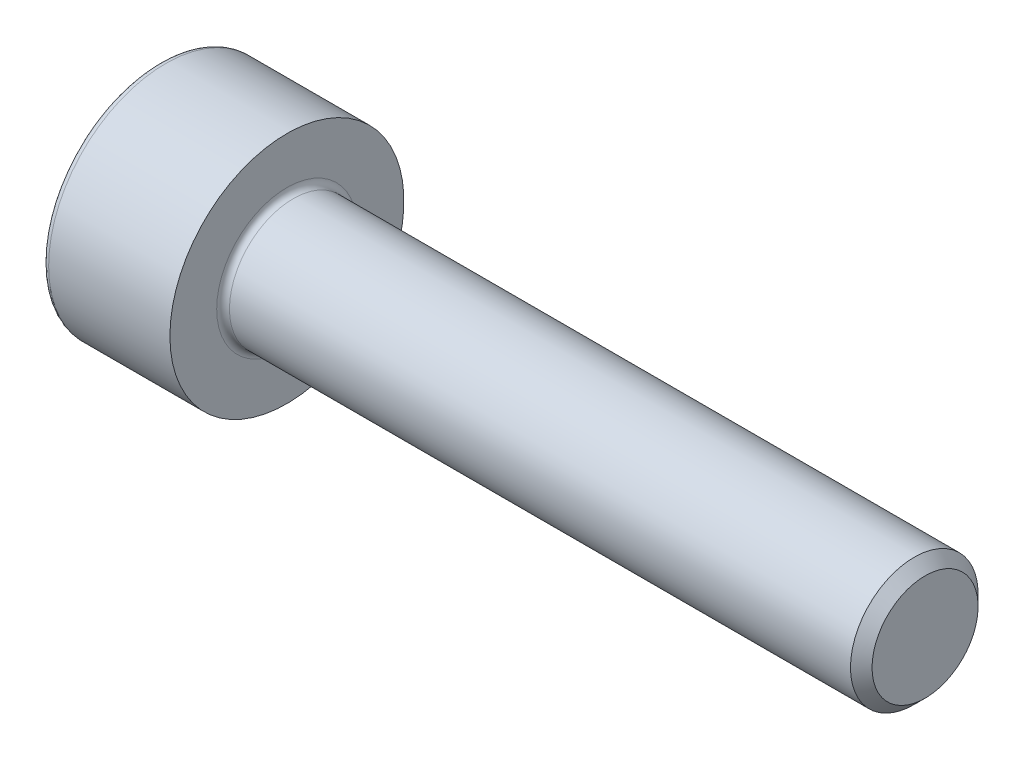
ISO-10303-21;
HEADER;
FILE_DESCRIPTION(('STEP AP214'),'2;1');
FILE_NAME('part.step','',(''),(''),'','','');
FILE_SCHEMA(('AUTOMOTIVE_DESIGN { 1 0 10303 214 1 1 1 1 }'));
ENDSEC;
DATA;
#1=APPLICATION_CONTEXT('core data for automotive mechanical design processes');
#2=APPLICATION_PROTOCOL_DEFINITION('international standard','automotive_design',2000,#1);
#3=PRODUCT_CONTEXT('',#1,'mechanical');
#4=PRODUCT('Part','Part','',(#3));
#5=PRODUCT_RELATED_PRODUCT_CATEGORY('part','',(#4));
#6=PRODUCT_DEFINITION_FORMATION('','',#4);
#7=PRODUCT_DEFINITION_CONTEXT('part definition',#1,'design');
#8=PRODUCT_DEFINITION('design','',#6,#7);
#9=PRODUCT_DEFINITION_SHAPE('','',#8);
#10=(LENGTH_UNIT() NAMED_UNIT(*) SI_UNIT(.MILLI.,.METRE.));
#11=(NAMED_UNIT(*) PLANE_ANGLE_UNIT() SI_UNIT($,.RADIAN.));
#12=(NAMED_UNIT(*) SI_UNIT($,.STERADIAN.) SOLID_ANGLE_UNIT());
#13=UNCERTAINTY_MEASURE_WITH_UNIT(LENGTH_MEASURE(1.E-05),#10,'distance_accuracy_value','');
#14=(GEOMETRIC_REPRESENTATION_CONTEXT(3) GLOBAL_UNCERTAINTY_ASSIGNED_CONTEXT((#13)) GLOBAL_UNIT_ASSIGNED_CONTEXT((#10,
#11,#12)) REPRESENTATION_CONTEXT('',''));
#15=CARTESIAN_POINT('',(0.,0.,0.));
#16=DIRECTION('',(0.,0.,1.));
#17=DIRECTION('',(1.,0.,0.));
#18=AXIS2_PLACEMENT_3D('',#15,#16,#17);
#19=CARTESIAN_POINT('',(15.,0.,0.));
#20=DIRECTION('',(-1.,0.,0.));
#21=DIRECTION('',(0.,0.,1.));
#22=AXIS2_PLACEMENT_3D('',#19,#20,#21);
#23=CONICAL_SURFACE('',#22,1.2464999999935,0.785398163397455);
#24=CARTESIAN_POINT('',(14.7464999999935,0.,0.));
#25=DIRECTION('',(-1.,0.,0.));
#26=DIRECTION('',(0.,0.,1.));
#27=AXIS2_PLACEMENT_3D('',#24,#25,#26);
#28=CIRCLE('',#27,1.5);
#29=CARTESIAN_POINT('',(14.7464999999935,0.,1.5));
#30=VERTEX_POINT('',#29);
#31=EDGE_CURVE('E11',#30,#30,#28,.T.);
#32=ORIENTED_EDGE('',*,*,#31,.F.);
#33=EDGE_LOOP('',(#32));
#34=FACE_BOUND('',#33,.T.);
#35=CARTESIAN_POINT('',(15.,0.,0.));
#36=DIRECTION('',(-1.,0.,0.));
#37=DIRECTION('',(0.,0.,1.));
#38=AXIS2_PLACEMENT_3D('',#35,#36,#37);
#39=CIRCLE('',#38,1.2464999999935);
#40=CARTESIAN_POINT('',(15.,0.,1.2464999999935));
#41=VERTEX_POINT('',#40);
#42=EDGE_CURVE('E134',#41,#41,#39,.T.);
#43=ORIENTED_EDGE('',*,*,#42,.T.);
#44=EDGE_LOOP('',(#43));
#45=FACE_BOUND('',#44,.T.);
#46=ADVANCED_FACE('F33',(#34,#45),#23,.T.);
#47=CARTESIAN_POINT('',(-3.,0.,0.));
#48=DIRECTION('',(-1.,0.,0.));
#49=DIRECTION('',(0.,0.,1.));
#50=AXIS2_PLACEMENT_3D('',#47,#48,#49);
#51=CYLINDRICAL_SURFACE('',#50,1.5);
#52=CARTESIAN_POINT('',(0.15,0.,0.));
#53=DIRECTION('',(-1.,0.,0.));
#54=DIRECTION('',(0.,0.,1.));
#55=AXIS2_PLACEMENT_3D('',#52,#53,#54);
#56=CIRCLE('',#55,1.5);
#57=CARTESIAN_POINT('',(0.15,0.,1.5));
#58=VERTEX_POINT('',#57);
#59=EDGE_CURVE('E40',#58,#58,#56,.T.);
#60=ORIENTED_EDGE('',*,*,#59,.F.);
#61=EDGE_LOOP('',(#60));
#62=FACE_BOUND('',#61,.T.);
#63=ORIENTED_EDGE('',*,*,#31,.T.);
#64=EDGE_LOOP('',(#63));
#65=FACE_BOUND('',#64,.T.);
#66=ADVANCED_FACE('F158',(#62,#65),#51,.T.);
#67=CARTESIAN_POINT('',(0.15,0.,0.));
#68=DIRECTION('',(-1.,0.,0.));
#69=DIRECTION('',(0.,0.,1.));
#70=AXIS2_PLACEMENT_3D('',#67,#68,#69);
#71=TOROIDAL_SURFACE('',#70,1.65,0.15);
#72=CARTESIAN_POINT('',(0.,0.,0.));
#73=DIRECTION('',(-1.,0.,0.));
#74=DIRECTION('',(0.,0.,1.));
#75=AXIS2_PLACEMENT_3D('',#72,#73,#74);
#76=CIRCLE('',#75,1.65);
#77=CARTESIAN_POINT('',(0.,0.,1.65));
#78=VERTEX_POINT('',#77);
#79=EDGE_CURVE('E151',#78,#78,#76,.T.);
#80=ORIENTED_EDGE('',*,*,#79,.F.);
#81=EDGE_LOOP('',(#80));
#82=FACE_BOUND('',#81,.T.);
#83=ORIENTED_EDGE('',*,*,#59,.T.);
#84=EDGE_LOOP('',(#83));
#85=FACE_BOUND('',#84,.T.);
#86=ADVANCED_FACE('F156',(#82,#85),#71,.F.);
#87=CARTESIAN_POINT('',(0.,1.65,0.));
#88=DIRECTION('',(-1.,0.,0.));
#89=DIRECTION('',(0.,0.,1.));
#90=AXIS2_PLACEMENT_3D('',#87,#88,#89);
#91=PLANE('',#90);
#92=CARTESIAN_POINT('',(0.,0.,0.));
#93=DIRECTION('',(-1.,0.,0.));
#94=DIRECTION('',(0.,0.,1.));
#95=AXIS2_PLACEMENT_3D('',#92,#93,#94);
#96=CIRCLE('',#95,2.75);
#97=CARTESIAN_POINT('',(0.,0.,2.75));
#98=VERTEX_POINT('',#97);
#99=EDGE_CURVE('E148',#98,#98,#96,.T.);
#100=ORIENTED_EDGE('',*,*,#99,.F.);
#101=EDGE_LOOP('',(#100));
#102=FACE_BOUND('',#101,.T.);
#103=ORIENTED_EDGE('',*,*,#79,.T.);
#104=EDGE_LOOP('',(#103));
#105=FACE_BOUND('',#104,.T.);
#106=ADVANCED_FACE('F189',(#102,#105),#91,.F.);
#107=CARTESIAN_POINT('',(-3.,0.,0.));
#108=DIRECTION('',(-1.,0.,0.));
#109=DIRECTION('',(0.,0.,1.));
#110=AXIS2_PLACEMENT_3D('',#107,#108,#109);
#111=CYLINDRICAL_SURFACE('',#110,2.75);
#112=CARTESIAN_POINT('',(-2.85,0.,0.));
#113=DIRECTION('',(-1.,0.,0.));
#114=DIRECTION('',(0.,0.,1.));
#115=AXIS2_PLACEMENT_3D('',#112,#113,#114);
#116=CIRCLE('',#115,2.75);
#117=CARTESIAN_POINT('',(-2.85,0.,2.75));
#118=VERTEX_POINT('',#117);
#119=EDGE_CURVE('E145',#118,#118,#116,.T.);
#120=ORIENTED_EDGE('',*,*,#119,.F.);
#121=EDGE_LOOP('',(#120));
#122=FACE_BOUND('',#121,.T.);
#123=ORIENTED_EDGE('',*,*,#99,.T.);
#124=EDGE_LOOP('',(#123));
#125=FACE_BOUND('',#124,.T.);
#126=ADVANCED_FACE('F185',(#122,#125),#111,.T.);
#127=CARTESIAN_POINT('',(-2.85,0.,0.));
#128=DIRECTION('',(-1.,0.,0.));
#129=DIRECTION('',(0.,0.,1.));
#130=AXIS2_PLACEMENT_3D('',#127,#128,#129);
#131=TOROIDAL_SURFACE('',#130,2.6,0.15);
#132=CARTESIAN_POINT('',(-3.,0.,0.));
#133=DIRECTION('',(-1.,0.,0.));
#134=DIRECTION('',(0.,0.,1.));
#135=AXIS2_PLACEMENT_3D('',#132,#133,#134);
#136=CIRCLE('',#135,2.6);
#137=CARTESIAN_POINT('',(-3.,0.,2.6));
#138=VERTEX_POINT('',#137);
#139=EDGE_CURVE('E142',#138,#138,#136,.T.);
#140=ORIENTED_EDGE('',*,*,#139,.F.);
#141=EDGE_LOOP('',(#140));
#142=FACE_BOUND('',#141,.T.);
#143=ORIENTED_EDGE('',*,*,#119,.T.);
#144=EDGE_LOOP('',(#143));
#145=FACE_BOUND('',#144,.T.);
#146=ADVANCED_FACE('F178',(#142,#145),#131,.T.);
#147=CARTESIAN_POINT('',(-3.,2.6,0.));
#148=DIRECTION('',(1.,0.,0.));
#149=DIRECTION('',(0.,0.,-1.));
#150=AXIS2_PLACEMENT_3D('',#147,#148,#149);
#151=PLANE('',#150);
#152=DIRECTION('',(0.,0.5,-0.866025403784438));
#153=VECTOR('',#152,1.);
#154=CARTESIAN_POINT('',(-3.,0.739008344562721,1.28));
#155=LINE('',#154,#153);
#156=CARTESIAN_POINT('',(-3.,0.739008344562721,1.28));
#157=VERTEX_POINT('',#156);
#158=CARTESIAN_POINT('',(-3.,1.47801668912544,0.));
#159=VERTEX_POINT('',#158);
#160=EDGE_CURVE('E121',#157,#159,#155,.T.);
#161=ORIENTED_EDGE('',*,*,#160,.F.);
#162=DIRECTION('',(0.,1.,0.));
#163=VECTOR('',#162,1.);
#164=CARTESIAN_POINT('',(-3.,-0.739008344562722,1.28));
#165=LINE('',#164,#163);
#166=CARTESIAN_POINT('',(-3.,-0.739008344562722,1.28));
#167=VERTEX_POINT('',#166);
#168=EDGE_CURVE('E47',#167,#157,#165,.T.);
#169=ORIENTED_EDGE('',*,*,#168,.F.);
#170=DIRECTION('',(0.,0.5,0.866025403784439));
#171=VECTOR('',#170,1.);
#172=CARTESIAN_POINT('',(-3.,-1.47801668912544,0.));
#173=LINE('',#172,#171);
#174=CARTESIAN_POINT('',(-3.,-1.47801668912544,0.));
#175=VERTEX_POINT('',#174);
#176=EDGE_CURVE('E130',#175,#167,#173,.T.);
#177=ORIENTED_EDGE('',*,*,#176,.F.);
#178=DIRECTION('',(0.,-0.5,0.866025403784439));
#179=VECTOR('',#178,1.);
#180=CARTESIAN_POINT('',(-3.,-0.739008344562721,-1.28));
#181=LINE('',#180,#179);
#182=CARTESIAN_POINT('',(-3.,-0.739008344562721,-1.28));
#183=VERTEX_POINT('',#182);
#184=EDGE_CURVE('E128',#183,#175,#181,.T.);
#185=ORIENTED_EDGE('',*,*,#184,.F.);
#186=DIRECTION('',(0.,-1.,0.));
#187=VECTOR('',#186,1.);
#188=CARTESIAN_POINT('',(-3.,0.739008344562722,-1.28));
#189=LINE('',#188,#187);
#190=CARTESIAN_POINT('',(-3.,0.739008344562722,-1.28));
#191=VERTEX_POINT('',#190);
#192=EDGE_CURVE('E95',#191,#183,#189,.T.);
#193=ORIENTED_EDGE('',*,*,#192,.F.);
#194=DIRECTION('',(0.,-0.5,-0.866025403784439));
#195=VECTOR('',#194,1.);
#196=CARTESIAN_POINT('',(-3.,1.47801668912544,0.));
#197=LINE('',#196,#195);
#198=EDGE_CURVE('E124',#159,#191,#197,.T.);
#199=ORIENTED_EDGE('',*,*,#198,.F.);
#200=EDGE_LOOP('',(#161,#169,#177,#185,#193,#199));
#201=FACE_BOUND('',#200,.T.);
#202=ORIENTED_EDGE('',*,*,#139,.T.);
#203=EDGE_LOOP('',(#202));
#204=FACE_BOUND('',#203,.T.);
#205=ADVANCED_FACE('F170',(#201,#204),#151,.F.);
#206=CARTESIAN_POINT('',(15.,1.2464999999935,0.));
#207=DIRECTION('',(-1.,0.,0.));
#208=DIRECTION('',(0.,0.,1.));
#209=AXIS2_PLACEMENT_3D('',#206,#207,#208);
#210=PLANE('',#209);
#211=ORIENTED_EDGE('',*,*,#42,.F.);
#212=EDGE_LOOP('',(#211));
#213=FACE_BOUND('',#212,.T.);
#214=ADVANCED_FACE('F167',(#213),#210,.F.);
#215=CARTESIAN_POINT('',(-1.7,-0.739008344562722,1.28));
#216=DIRECTION('',(0.,0.,1.));
#217=DIRECTION('',(1.,0.,0.));
#218=AXIS2_PLACEMENT_3D('',#215,#216,#217);
#219=PLANE('',#218);
#220=ORIENTED_EDGE('',*,*,#168,.T.);
#221=DIRECTION('',(-1.,0.,0.));
#222=VECTOR('',#221,1.);
#223=CARTESIAN_POINT('',(-1.7,0.739008344562721,1.28));
#224=LINE('',#223,#222);
#225=CARTESIAN_POINT('',(-1.7,0.739008344562721,1.28));
#226=VERTEX_POINT('',#225);
#227=EDGE_CURVE('E77',#226,#157,#224,.T.);
#228=ORIENTED_EDGE('',*,*,#227,.F.);
#229=DIRECTION('',(0.,1.,0.));
#230=VECTOR('',#229,1.);
#231=CARTESIAN_POINT('',(-1.7,-0.739008344562722,1.28));
#232=LINE('',#231,#230);
#233=CARTESIAN_POINT('',(-1.7,-0.739008344562722,1.28));
#234=VERTEX_POINT('',#233);
#235=EDGE_CURVE('E132',#234,#226,#232,.T.);
#236=ORIENTED_EDGE('',*,*,#235,.F.);
#237=DIRECTION('',(-1.,0.,0.));
#238=VECTOR('',#237,1.);
#239=CARTESIAN_POINT('',(-1.7,-0.739008344562722,1.28));
#240=LINE('',#239,#238);
#241=EDGE_CURVE('E55',#234,#167,#240,.T.);
#242=ORIENTED_EDGE('',*,*,#241,.T.);
#243=EDGE_LOOP('',(#220,#228,#236,#242));
#244=FACE_BOUND('',#243,.T.);
#245=ADVANCED_FACE('F169',(#244),#219,.F.);
#246=CARTESIAN_POINT('',(-1.7,-1.47801668912544,0.));
#247=DIRECTION('',(0.,-0.866025403784439,0.5));
#248=DIRECTION('',(0.,-0.5,-0.866025403784439));
#249=AXIS2_PLACEMENT_3D('',#246,#247,#248);
#250=PLANE('',#249);
#251=ORIENTED_EDGE('',*,*,#176,.T.);
#252=ORIENTED_EDGE('',*,*,#241,.F.);
#253=DIRECTION('',(0.,0.5,0.866025403784439));
#254=VECTOR('',#253,1.);
#255=CARTESIAN_POINT('',(-1.7,-1.47801668912544,0.));
#256=LINE('',#255,#254);
#257=CARTESIAN_POINT('',(-1.7,-1.47801668912544,0.));
#258=VERTEX_POINT('',#257);
#259=EDGE_CURVE('E107',#258,#234,#256,.T.);
#260=ORIENTED_EDGE('',*,*,#259,.F.);
#261=DIRECTION('',(-1.,0.,0.));
#262=VECTOR('',#261,1.);
#263=CARTESIAN_POINT('',(-1.7,-1.47801668912544,0.));
#264=LINE('',#263,#262);
#265=EDGE_CURVE('E99',#258,#175,#264,.T.);
#266=ORIENTED_EDGE('',*,*,#265,.T.);
#267=EDGE_LOOP('',(#251,#252,#260,#266));
#268=FACE_BOUND('',#267,.T.);
#269=ADVANCED_FACE('F176',(#268),#250,.F.);
#270=CARTESIAN_POINT('',(-1.7,-0.739008344562721,-1.28));
#271=DIRECTION('',(0.,-0.866025403784439,-0.5));
#272=DIRECTION('',(0.,0.5,-0.866025403784439));
#273=AXIS2_PLACEMENT_3D('',#270,#271,#272);
#274=PLANE('',#273);
#275=ORIENTED_EDGE('',*,*,#184,.T.);
#276=ORIENTED_EDGE('',*,*,#265,.F.);
#277=DIRECTION('',(0.,-0.5,0.866025403784439));
#278=VECTOR('',#277,1.);
#279=CARTESIAN_POINT('',(-1.7,-0.739008344562721,-1.28));
#280=LINE('',#279,#278);
#281=CARTESIAN_POINT('',(-1.7,-0.739008344562721,-1.28));
#282=VERTEX_POINT('',#281);
#283=EDGE_CURVE('E103',#282,#258,#280,.T.);
#284=ORIENTED_EDGE('',*,*,#283,.F.);
#285=DIRECTION('',(-1.,0.,0.));
#286=VECTOR('',#285,1.);
#287=CARTESIAN_POINT('',(-1.7,-0.739008344562721,-1.28));
#288=LINE('',#287,#286);
#289=EDGE_CURVE('E88',#282,#183,#288,.T.);
#290=ORIENTED_EDGE('',*,*,#289,.T.);
#291=EDGE_LOOP('',(#275,#276,#284,#290));
#292=FACE_BOUND('',#291,.T.);
#293=ADVANCED_FACE('F104',(#292),#274,.F.);
#294=CARTESIAN_POINT('',(-1.7,0.739008344562722,-1.28));
#295=DIRECTION('',(0.,0.,-1.));
#296=DIRECTION('',(0.,1.,0.));
#297=AXIS2_PLACEMENT_3D('',#294,#295,#296);
#298=PLANE('',#297);
#299=ORIENTED_EDGE('',*,*,#192,.T.);
#300=ORIENTED_EDGE('',*,*,#289,.F.);
#301=DIRECTION('',(0.,-1.,0.));
#302=VECTOR('',#301,1.);
#303=CARTESIAN_POINT('',(-1.7,0.739008344562722,-1.28));
#304=LINE('',#303,#302);
#305=CARTESIAN_POINT('',(-1.7,0.739008344562722,-1.28));
#306=VERTEX_POINT('',#305);
#307=EDGE_CURVE('E92',#306,#282,#304,.T.);
#308=ORIENTED_EDGE('',*,*,#307,.F.);
#309=DIRECTION('',(-1.,0.,0.));
#310=VECTOR('',#309,1.);
#311=CARTESIAN_POINT('',(-1.7,0.739008344562722,-1.28));
#312=LINE('',#311,#310);
#313=EDGE_CURVE('E100',#306,#191,#312,.T.);
#314=ORIENTED_EDGE('',*,*,#313,.T.);
#315=EDGE_LOOP('',(#299,#300,#308,#314));
#316=FACE_BOUND('',#315,.T.);
#317=ADVANCED_FACE('F90',(#316),#298,.F.);
#318=CARTESIAN_POINT('',(-1.7,1.47801668912544,0.));
#319=DIRECTION('',(0.,0.866025403784439,-0.5));
#320=DIRECTION('',(0.,0.5,0.866025403784439));
#321=AXIS2_PLACEMENT_3D('',#318,#319,#320);
#322=PLANE('',#321);
#323=ORIENTED_EDGE('',*,*,#198,.T.);
#324=ORIENTED_EDGE('',*,*,#313,.F.);
#325=DIRECTION('',(0.,-0.5,-0.866025403784439));
#326=VECTOR('',#325,1.);
#327=CARTESIAN_POINT('',(-1.7,1.47801668912544,0.));
#328=LINE('',#327,#326);
#329=CARTESIAN_POINT('',(-1.7,1.47801668912544,0.));
#330=VERTEX_POINT('',#329);
#331=EDGE_CURVE('E113',#330,#306,#328,.T.);
#332=ORIENTED_EDGE('',*,*,#331,.F.);
#333=DIRECTION('',(-1.,0.,0.));
#334=VECTOR('',#333,1.);
#335=CARTESIAN_POINT('',(-1.7,1.47801668912544,0.));
#336=LINE('',#335,#334);
#337=EDGE_CURVE('E137',#330,#159,#336,.T.);
#338=ORIENTED_EDGE('',*,*,#337,.T.);
#339=EDGE_LOOP('',(#323,#324,#332,#338));
#340=FACE_BOUND('',#339,.T.);
#341=ADVANCED_FACE('F251',(#340),#322,.F.);
#342=CARTESIAN_POINT('',(-1.7,0.739008344562721,1.28));
#343=DIRECTION('',(0.,0.866025403784439,0.5));
#344=DIRECTION('',(0.,-0.5,0.866025403784439));
#345=AXIS2_PLACEMENT_3D('',#342,#343,#344);
#346=PLANE('',#345);
#347=ORIENTED_EDGE('',*,*,#160,.T.);
#348=ORIENTED_EDGE('',*,*,#337,.F.);
#349=DIRECTION('',(0.,0.5,-0.866025403784438));
#350=VECTOR('',#349,1.);
#351=CARTESIAN_POINT('',(-1.7,0.739008344562721,1.28));
#352=LINE('',#351,#350);
#353=EDGE_CURVE('E115',#226,#330,#352,.T.);
#354=ORIENTED_EDGE('',*,*,#353,.F.);
#355=ORIENTED_EDGE('',*,*,#227,.T.);
#356=EDGE_LOOP('',(#347,#348,#354,#355));
#357=FACE_BOUND('',#356,.T.);
#358=ADVANCED_FACE('F260',(#357),#346,.F.);
#359=CARTESIAN_POINT('',(-1.7,0.,0.));
#360=DIRECTION('',(-1.,0.,0.));
#361=DIRECTION('',(0.,0.,1.));
#362=AXIS2_PLACEMENT_3D('',#359,#360,#361);
#363=PLANE('',#362);
#364=ORIENTED_EDGE('',*,*,#235,.T.);
#365=ORIENTED_EDGE('',*,*,#353,.T.);
#366=ORIENTED_EDGE('',*,*,#331,.T.);
#367=ORIENTED_EDGE('',*,*,#307,.T.);
#368=ORIENTED_EDGE('',*,*,#283,.T.);
#369=ORIENTED_EDGE('',*,*,#259,.T.);
#370=EDGE_LOOP('',(#364,#365,#366,#367,#368,#369));
#371=FACE_BOUND('',#370,.T.);
#372=ADVANCED_FACE('F110',(#371),#363,.T.);
#373=CLOSED_SHELL('',(#46,#66,#86,#106,#126,#146,#205,#214,#245,#269,#293,#317,#341,#358,#372));
#374=MANIFOLD_SOLID_BREP('B2',#373);
#375=ADVANCED_BREP_SHAPE_REPRESENTATION('',(#18,#374),#14);
#376=SHAPE_DEFINITION_REPRESENTATION(#9,#375);
ENDSEC;
END-ISO-10303-21;
